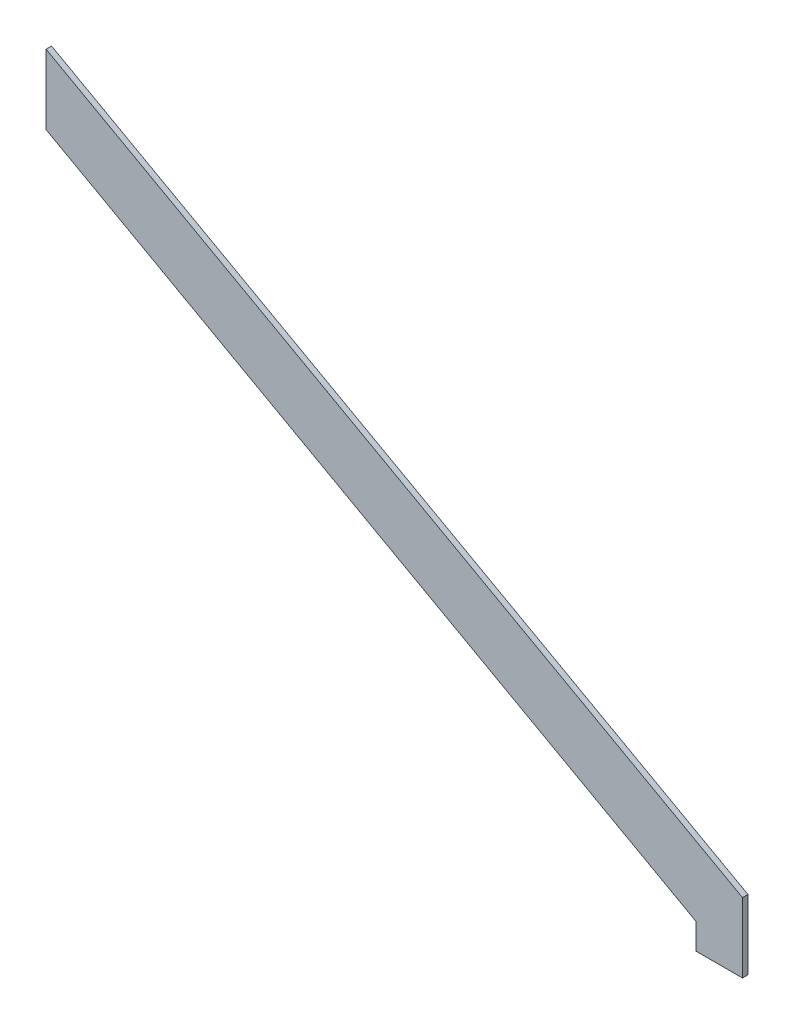
ISO-10303-21;
HEADER;
FILE_DESCRIPTION(('STEP AP214'),'2;1');
FILE_NAME('part.step','',(''),(''),'','','');
FILE_SCHEMA(('AUTOMOTIVE_DESIGN { 1 0 10303 214 1 1 1 1 }'));
ENDSEC;
DATA;
#1=APPLICATION_CONTEXT('core data for automotive mechanical design processes');
#2=APPLICATION_PROTOCOL_DEFINITION('international standard','automotive_design',2000,#1);
#3=PRODUCT_CONTEXT('',#1,'mechanical');
#4=PRODUCT('Part','Part','',(#3));
#5=PRODUCT_RELATED_PRODUCT_CATEGORY('part','',(#4));
#6=PRODUCT_DEFINITION_FORMATION('','',#4);
#7=PRODUCT_DEFINITION_CONTEXT('part definition',#1,'design');
#8=PRODUCT_DEFINITION('design','',#6,#7);
#9=PRODUCT_DEFINITION_SHAPE('','',#8);
#10=(LENGTH_UNIT() NAMED_UNIT(*) SI_UNIT(.MILLI.,.METRE.));
#11=(NAMED_UNIT(*) PLANE_ANGLE_UNIT() SI_UNIT($,.RADIAN.));
#12=(NAMED_UNIT(*) SI_UNIT($,.STERADIAN.) SOLID_ANGLE_UNIT());
#13=UNCERTAINTY_MEASURE_WITH_UNIT(LENGTH_MEASURE(1.E-05),#10,'distance_accuracy_value','');
#14=(GEOMETRIC_REPRESENTATION_CONTEXT(3) GLOBAL_UNCERTAINTY_ASSIGNED_CONTEXT((#13)) GLOBAL_UNIT_ASSIGNED_CONTEXT((#10,
#11,#12)) REPRESENTATION_CONTEXT('',''));
#15=CARTESIAN_POINT('',(0.,0.,0.));
#16=DIRECTION('',(0.,0.,1.));
#17=DIRECTION('',(1.,0.,0.));
#18=AXIS2_PLACEMENT_3D('',#15,#16,#17);
#19=CARTESIAN_POINT('',(-381.,249.561110197223,3.));
#20=DIRECTION('',(1.,0.,0.));
#21=DIRECTION('',(0.,0.,-1.));
#22=AXIS2_PLACEMENT_3D('',#19,#20,#21);
#23=PLANE('',#22);
#24=DIRECTION('',(0.,-1.,0.));
#25=VECTOR('',#24,1.);
#26=CARTESIAN_POINT('',(-381.,249.561110197223,0.));
#27=LINE('',#26,#25);
#28=CARTESIAN_POINT('',(-381.,249.561110197223,0.));
#29=VERTEX_POINT('',#28);
#30=CARTESIAN_POINT('',(-381.,211.461110197223,0.));
#31=VERTEX_POINT('',#30);
#32=EDGE_CURVE('E138',#29,#31,#27,.T.);
#33=ORIENTED_EDGE('',*,*,#32,.T.);
#34=DIRECTION('',(0.,0.,-1.));
#35=VECTOR('',#34,1.);
#36=CARTESIAN_POINT('',(-381.,211.461110197223,3.));
#37=LINE('',#36,#35);
#38=CARTESIAN_POINT('',(-381.,211.461110197223,3.));
#39=VERTEX_POINT('',#38);
#40=EDGE_CURVE('E12',#39,#31,#37,.T.);
#41=ORIENTED_EDGE('',*,*,#40,.F.);
#42=DIRECTION('',(0.,-1.,0.));
#43=VECTOR('',#42,1.);
#44=CARTESIAN_POINT('',(-381.,249.561110197223,3.));
#45=LINE('',#44,#43);
#46=CARTESIAN_POINT('',(-381.,249.561110197223,3.));
#47=VERTEX_POINT('',#46);
#48=EDGE_CURVE('E139',#47,#39,#45,.T.);
#49=ORIENTED_EDGE('',*,*,#48,.F.);
#50=DIRECTION('',(0.,0.,-1.));
#51=VECTOR('',#50,1.);
#52=CARTESIAN_POINT('',(-381.,249.561110197223,3.));
#53=LINE('',#52,#51);
#54=EDGE_CURVE('E151',#47,#29,#53,.T.);
#55=ORIENTED_EDGE('',*,*,#54,.T.);
#56=EDGE_LOOP('',(#33,#41,#49,#55));
#57=FACE_BOUND('',#56,.T.);
#58=ADVANCED_FACE('F56',(#57),#23,.F.);
#59=CARTESIAN_POINT('',(-381.,211.461110197223,3.));
#60=DIRECTION('',(0.485282415551808,0.874357465317362,0.));
#61=DIRECTION('',(-0.874357465317362,0.485282415551808,0.));
#62=AXIS2_PLACEMENT_3D('',#59,#60,#61);
#63=PLANE('',#62);
#64=DIRECTION('',(0.874357465317362,-0.485282415551808,0.));
#65=VECTOR('',#64,1.);
#66=CARTESIAN_POINT('',(-381.,211.461110197223,0.));
#67=LINE('',#66,#65);
#68=CARTESIAN_POINT('',(-25.4,14.0974073464815,0.));
#69=VERTEX_POINT('',#68);
#70=EDGE_CURVE('E75',#31,#69,#67,.T.);
#71=ORIENTED_EDGE('',*,*,#70,.T.);
#72=DIRECTION('',(0.,0.,1.));
#73=VECTOR('',#72,1.);
#74=CARTESIAN_POINT('',(-25.4,14.0974073464815,-29.0499035091794));
#75=LINE('',#74,#73);
#76=CARTESIAN_POINT('',(-25.4,14.0974073464815,3.));
#77=VERTEX_POINT('',#76);
#78=EDGE_CURVE('E71',#69,#77,#75,.T.);
#79=ORIENTED_EDGE('',*,*,#78,.T.);
#80=DIRECTION('',(0.874357465317362,-0.485282415551808,0.));
#81=VECTOR('',#80,1.);
#82=CARTESIAN_POINT('',(-381.,211.461110197223,3.));
#83=LINE('',#82,#81);
#84=EDGE_CURVE('E124',#39,#77,#83,.T.);
#85=ORIENTED_EDGE('',*,*,#84,.F.);
#86=ORIENTED_EDGE('',*,*,#40,.T.);
#87=EDGE_LOOP('',(#71,#79,#85,#86));
#88=FACE_BOUND('',#87,.T.);
#89=ADVANCED_FACE('F184',(#88),#63,.F.);
#90=CARTESIAN_POINT('',(0.,0.,3.));
#91=DIRECTION('',(-1.,0.,0.));
#92=DIRECTION('',(0.,-1.,0.));
#93=AXIS2_PLACEMENT_3D('',#90,#91,#92);
#94=PLANE('',#93);
#95=DIRECTION('',(0.,1.,0.));
#96=VECTOR('',#95,1.);
#97=CARTESIAN_POINT('',(0.,0.,0.));
#98=LINE('',#97,#96);
#99=CARTESIAN_POINT('',(0.,0.,0.));
#100=VERTEX_POINT('',#99);
#101=CARTESIAN_POINT('',(0.,38.1,0.));
#102=VERTEX_POINT('',#101);
#103=EDGE_CURVE('E157',#100,#102,#98,.T.);
#104=ORIENTED_EDGE('',*,*,#103,.T.);
#105=DIRECTION('',(0.,0.,-1.));
#106=VECTOR('',#105,1.);
#107=CARTESIAN_POINT('',(0.,38.1,3.));
#108=LINE('',#107,#106);
#109=CARTESIAN_POINT('',(0.,38.1,3.));
#110=VERTEX_POINT('',#109);
#111=EDGE_CURVE('E165',#110,#102,#108,.T.);
#112=ORIENTED_EDGE('',*,*,#111,.F.);
#113=DIRECTION('',(0.,1.,0.));
#114=VECTOR('',#113,1.);
#115=CARTESIAN_POINT('',(0.,0.,3.));
#116=LINE('',#115,#114);
#117=CARTESIAN_POINT('',(0.,0.,3.));
#118=VERTEX_POINT('',#117);
#119=EDGE_CURVE('E145',#118,#110,#116,.T.);
#120=ORIENTED_EDGE('',*,*,#119,.F.);
#121=DIRECTION('',(0.,0.,-1.));
#122=VECTOR('',#121,1.);
#123=CARTESIAN_POINT('',(0.,0.,3.));
#124=LINE('',#123,#122);
#125=EDGE_CURVE('E64',#118,#100,#124,.T.);
#126=ORIENTED_EDGE('',*,*,#125,.T.);
#127=EDGE_LOOP('',(#104,#112,#120,#126));
#128=FACE_BOUND('',#127,.T.);
#129=ADVANCED_FACE('F170',(#128),#94,.F.);
#130=CARTESIAN_POINT('',(0.,38.1,3.));
#131=DIRECTION('',(-0.485282415551808,-0.874357465317362,0.));
#132=DIRECTION('',(0.874357465317362,-0.485282415551809,0.));
#133=AXIS2_PLACEMENT_3D('',#130,#131,#132);
#134=PLANE('',#133);
#135=DIRECTION('',(-0.874357465317362,0.485282415551808,0.));
#136=VECTOR('',#135,1.);
#137=CARTESIAN_POINT('',(0.,38.1,0.));
#138=LINE('',#137,#136);
#139=EDGE_CURVE('E142',#102,#29,#138,.T.);
#140=ORIENTED_EDGE('',*,*,#139,.T.);
#141=ORIENTED_EDGE('',*,*,#54,.F.);
#142=DIRECTION('',(-0.874357465317362,0.485282415551808,0.));
#143=VECTOR('',#142,1.);
#144=CARTESIAN_POINT('',(0.,38.1,3.));
#145=LINE('',#144,#143);
#146=EDGE_CURVE('E148',#110,#47,#145,.T.);
#147=ORIENTED_EDGE('',*,*,#146,.F.);
#148=ORIENTED_EDGE('',*,*,#111,.T.);
#149=EDGE_LOOP('',(#140,#141,#147,#148));
#150=FACE_BOUND('',#149,.T.);
#151=ADVANCED_FACE('F179',(#150),#134,.F.);
#152=CARTESIAN_POINT('',(0.,0.,3.));
#153=DIRECTION('',(0.,0.,1.));
#154=DIRECTION('',(1.,0.,0.));
#155=AXIS2_PLACEMENT_3D('',#152,#153,#154);
#156=PLANE('',#155);
#157=ORIENTED_EDGE('',*,*,#48,.T.);
#158=ORIENTED_EDGE('',*,*,#84,.T.);
#159=DIRECTION('',(0.,-1.,0.));
#160=VECTOR('',#159,1.);
#161=CARTESIAN_POINT('',(-25.4,0.,3.));
#162=LINE('',#161,#160);
#163=CARTESIAN_POINT('',(-25.4,0.,3.));
#164=VERTEX_POINT('',#163);
#165=EDGE_CURVE('E111',#77,#164,#162,.T.);
#166=ORIENTED_EDGE('',*,*,#165,.T.);
#167=DIRECTION('',(1.,0.,0.));
#168=VECTOR('',#167,1.);
#169=CARTESIAN_POINT('',(0.,0.,3.));
#170=LINE('',#169,#168);
#171=EDGE_CURVE('E123',#164,#118,#170,.T.);
#172=ORIENTED_EDGE('',*,*,#171,.T.);
#173=ORIENTED_EDGE('',*,*,#119,.T.);
#174=ORIENTED_EDGE('',*,*,#146,.T.);
#175=EDGE_LOOP('',(#157,#158,#166,#172,#173,#174));
#176=FACE_BOUND('',#175,.T.);
#177=ADVANCED_FACE('F122',(#176),#156,.T.);
#178=CARTESIAN_POINT('',(0.,0.,0.));
#179=DIRECTION('',(0.,0.,1.));
#180=DIRECTION('',(1.,0.,0.));
#181=AXIS2_PLACEMENT_3D('',#178,#179,#180);
#182=PLANE('',#181);
#183=ORIENTED_EDGE('',*,*,#32,.F.);
#184=ORIENTED_EDGE('',*,*,#139,.F.);
#185=ORIENTED_EDGE('',*,*,#103,.F.);
#186=DIRECTION('',(-1.,0.,0.));
#187=VECTOR('',#186,1.);
#188=CARTESIAN_POINT('',(0.,0.,0.));
#189=LINE('',#188,#187);
#190=CARTESIAN_POINT('',(-25.4,0.,0.));
#191=VERTEX_POINT('',#190);
#192=EDGE_CURVE('E117',#100,#191,#189,.T.);
#193=ORIENTED_EDGE('',*,*,#192,.T.);
#194=DIRECTION('',(0.,1.,0.));
#195=VECTOR('',#194,1.);
#196=CARTESIAN_POINT('',(-25.4,0.,0.));
#197=LINE('',#196,#195);
#198=EDGE_CURVE('E112',#191,#69,#197,.T.);
#199=ORIENTED_EDGE('',*,*,#198,.T.);
#200=ORIENTED_EDGE('',*,*,#70,.F.);
#201=EDGE_LOOP('',(#183,#184,#185,#193,#199,#200));
#202=FACE_BOUND('',#201,.T.);
#203=ADVANCED_FACE('F175',(#202),#182,.F.);
#204=CARTESIAN_POINT('',(0.,0.,-29.0499035091794));
#205=DIRECTION('',(0.,-1.,0.));
#206=DIRECTION('',(1.,0.,0.));
#207=AXIS2_PLACEMENT_3D('',#204,#205,#206);
#208=PLANE('',#207);
#209=ORIENTED_EDGE('',*,*,#192,.F.);
#210=ORIENTED_EDGE('',*,*,#125,.F.);
#211=ORIENTED_EDGE('',*,*,#171,.F.);
#212=DIRECTION('',(0.,0.,1.));
#213=VECTOR('',#212,1.);
#214=CARTESIAN_POINT('',(-25.4,0.,-29.0499035091794));
#215=LINE('',#214,#213);
#216=EDGE_CURVE('E108',#191,#164,#215,.T.);
#217=ORIENTED_EDGE('',*,*,#216,.F.);
#218=EDGE_LOOP('',(#209,#210,#211,#217));
#219=FACE_BOUND('',#218,.T.);
#220=ADVANCED_FACE('F128',(#219),#208,.T.);
#221=CARTESIAN_POINT('',(-25.4,0.,-29.0499035091794));
#222=DIRECTION('',(-1.,0.,0.));
#223=DIRECTION('',(0.,0.,1.));
#224=AXIS2_PLACEMENT_3D('',#221,#222,#223);
#225=PLANE('',#224);
#226=ORIENTED_EDGE('',*,*,#198,.F.);
#227=ORIENTED_EDGE('',*,*,#216,.T.);
#228=ORIENTED_EDGE('',*,*,#165,.F.);
#229=ORIENTED_EDGE('',*,*,#78,.F.);
#230=EDGE_LOOP('',(#226,#227,#228,#229));
#231=FACE_BOUND('',#230,.T.);
#232=ADVANCED_FACE('F110',(#231),#225,.T.);
#233=CLOSED_SHELL('',(#58,#89,#129,#151,#177,#203,#220,#232));
#234=MANIFOLD_SOLID_BREP('B2',#233);
#235=ADVANCED_BREP_SHAPE_REPRESENTATION('',(#18,#234),#14);
#236=SHAPE_DEFINITION_REPRESENTATION(#9,#235);
ENDSEC;
END-ISO-10303-21;
